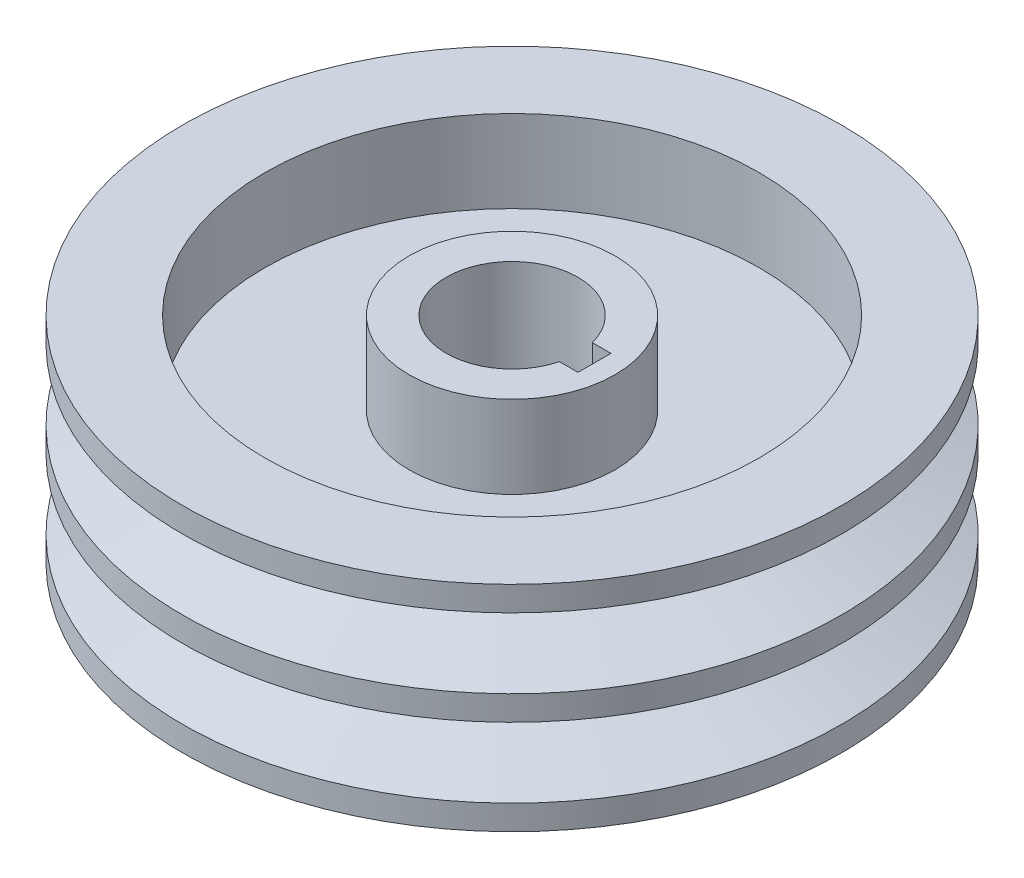
ISO-10303-21;
HEADER;
FILE_DESCRIPTION(('STEP AP214'),'2;1');
FILE_NAME('part.step','',(''),(''),'','','');
FILE_SCHEMA(('AUTOMOTIVE_DESIGN { 1 0 10303 214 1 1 1 1 }'));
ENDSEC;
DATA;
#1=APPLICATION_CONTEXT('core data for automotive mechanical design processes');
#2=APPLICATION_PROTOCOL_DEFINITION('international standard','automotive_design',2000,#1);
#3=PRODUCT_CONTEXT('',#1,'mechanical');
#4=PRODUCT('Part','Part','',(#3));
#5=PRODUCT_RELATED_PRODUCT_CATEGORY('part','',(#4));
#6=PRODUCT_DEFINITION_FORMATION('','',#4);
#7=PRODUCT_DEFINITION_CONTEXT('part definition',#1,'design');
#8=PRODUCT_DEFINITION('design','',#6,#7);
#9=PRODUCT_DEFINITION_SHAPE('','',#8);
#10=(LENGTH_UNIT() NAMED_UNIT(*) SI_UNIT(.MILLI.,.METRE.));
#11=(NAMED_UNIT(*) PLANE_ANGLE_UNIT() SI_UNIT($,.RADIAN.));
#12=(NAMED_UNIT(*) SI_UNIT($,.STERADIAN.) SOLID_ANGLE_UNIT());
#13=UNCERTAINTY_MEASURE_WITH_UNIT(LENGTH_MEASURE(1.E-05),#10,'distance_accuracy_value','');
#14=(GEOMETRIC_REPRESENTATION_CONTEXT(3) GLOBAL_UNCERTAINTY_ASSIGNED_CONTEXT((#13)) GLOBAL_UNIT_ASSIGNED_CONTEXT((#10,
#11,#12)) REPRESENTATION_CONTEXT('',''));
#15=CARTESIAN_POINT('',(0.,0.,0.));
#16=DIRECTION('',(0.,0.,1.));
#17=DIRECTION('',(1.,0.,0.));
#18=AXIS2_PLACEMENT_3D('',#15,#16,#17);
#19=CARTESIAN_POINT('',(0.,1.5,0.));
#20=DIRECTION('',(0.,-1.,0.));
#21=DIRECTION('',(0.,0.,-1.));
#22=AXIS2_PLACEMENT_3D('',#19,#20,#21);
#23=CONICAL_SURFACE('',#22,40.,1.22173047639603);
#24=CARTESIAN_POINT('',(0.,4.4117618741296,0.));
#25=DIRECTION('',(0.,-1.,0.));
#26=DIRECTION('',(0.,0.,-1.));
#27=AXIS2_PLACEMENT_3D('',#24,#25,#26);
#28=CIRCLE('',#27,32.);
#29=CARTESIAN_POINT('',(0.,4.4117618741296,-32.));
#30=VERTEX_POINT('',#29);
#31=EDGE_CURVE('E39',#30,#30,#28,.T.);
#32=ORIENTED_EDGE('',*,*,#31,.T.);
#33=EDGE_LOOP('',(#32));
#34=FACE_BOUND('',#33,.T.);
#35=CARTESIAN_POINT('',(0.,1.5,0.));
#36=DIRECTION('',(0.,-1.,0.));
#37=DIRECTION('',(0.,0.,-1.));
#38=AXIS2_PLACEMENT_3D('',#35,#36,#37);
#39=CIRCLE('',#38,40.);
#40=CARTESIAN_POINT('',(0.,1.5,-40.));
#41=VERTEX_POINT('',#40);
#42=EDGE_CURVE('E100',#41,#41,#39,.T.);
#43=ORIENTED_EDGE('',*,*,#42,.F.);
#44=EDGE_LOOP('',(#43));
#45=FACE_BOUND('',#44,.T.);
#46=ADVANCED_FACE('F32',(#34,#45),#23,.T.);
#47=CARTESIAN_POINT('',(0.,0.,0.));
#48=DIRECTION('',(0.,-1.,0.));
#49=DIRECTION('',(0.,0.,-1.));
#50=AXIS2_PLACEMENT_3D('',#47,#48,#49);
#51=CYLINDRICAL_SURFACE('',#50,32.);
#52=CARTESIAN_POINT('',(0.,7.0882381258704,0.));
#53=DIRECTION('',(0.,-1.,0.));
#54=DIRECTION('',(0.,0.,-1.));
#55=AXIS2_PLACEMENT_3D('',#52,#53,#54);
#56=CIRCLE('',#55,32.);
#57=CARTESIAN_POINT('',(0.,7.0882381258704,-32.));
#58=VERTEX_POINT('',#57);
#59=EDGE_CURVE('E153',#58,#58,#56,.T.);
#60=ORIENTED_EDGE('',*,*,#59,.T.);
#61=EDGE_LOOP('',(#60));
#62=FACE_BOUND('',#61,.T.);
#63=ORIENTED_EDGE('',*,*,#31,.F.);
#64=EDGE_LOOP('',(#63));
#65=FACE_BOUND('',#64,.T.);
#66=ADVANCED_FACE('F160',(#62,#65),#51,.T.);
#67=CARTESIAN_POINT('',(0.,7.0882381258704,0.));
#68=DIRECTION('',(0.,1.,0.));
#69=DIRECTION('',(0.,0.,1.));
#70=AXIS2_PLACEMENT_3D('',#67,#68,#69);
#71=CONICAL_SURFACE('',#70,32.,1.22173047639603);
#72=CARTESIAN_POINT('',(0.,10.,0.));
#73=DIRECTION('',(0.,-1.,0.));
#74=DIRECTION('',(0.,0.,-1.));
#75=AXIS2_PLACEMENT_3D('',#72,#73,#74);
#76=CIRCLE('',#75,40.);
#77=CARTESIAN_POINT('',(0.,10.,-40.));
#78=VERTEX_POINT('',#77);
#79=EDGE_CURVE('E150',#78,#78,#76,.T.);
#80=ORIENTED_EDGE('',*,*,#79,.T.);
#81=EDGE_LOOP('',(#80));
#82=FACE_BOUND('',#81,.T.);
#83=ORIENTED_EDGE('',*,*,#59,.F.);
#84=EDGE_LOOP('',(#83));
#85=FACE_BOUND('',#84,.T.);
#86=ADVANCED_FACE('F162',(#82,#85),#71,.T.);
#87=CARTESIAN_POINT('',(0.,0.,0.));
#88=DIRECTION('',(0.,-1.,0.));
#89=DIRECTION('',(0.,0.,-1.));
#90=AXIS2_PLACEMENT_3D('',#87,#88,#89);
#91=CYLINDRICAL_SURFACE('',#90,40.);
#92=CARTESIAN_POINT('',(0.,13.,0.));
#93=DIRECTION('',(0.,-1.,0.));
#94=DIRECTION('',(0.,0.,-1.));
#95=AXIS2_PLACEMENT_3D('',#92,#93,#94);
#96=CIRCLE('',#95,40.);
#97=CARTESIAN_POINT('',(0.,13.,-40.));
#98=VERTEX_POINT('',#97);
#99=EDGE_CURVE('E147',#98,#98,#96,.T.);
#100=ORIENTED_EDGE('',*,*,#99,.T.);
#101=EDGE_LOOP('',(#100));
#102=FACE_BOUND('',#101,.T.);
#103=ORIENTED_EDGE('',*,*,#79,.F.);
#104=EDGE_LOOP('',(#103));
#105=FACE_BOUND('',#104,.T.);
#106=ADVANCED_FACE('F168',(#102,#105),#91,.T.);
#107=CARTESIAN_POINT('',(30.,13.,0.));
#108=DIRECTION('',(0.,1.,0.));
#109=DIRECTION('',(0.,0.,1.));
#110=AXIS2_PLACEMENT_3D('',#107,#108,#109);
#111=PLANE('',#110);
#112=CARTESIAN_POINT('',(0.,13.,0.));
#113=DIRECTION('',(0.,-1.,0.));
#114=DIRECTION('',(0.,0.,-1.));
#115=AXIS2_PLACEMENT_3D('',#112,#113,#114);
#116=CIRCLE('',#115,30.);
#117=CARTESIAN_POINT('',(0.,13.,-30.));
#118=VERTEX_POINT('',#117);
#119=EDGE_CURVE('E144',#118,#118,#116,.T.);
#120=ORIENTED_EDGE('',*,*,#119,.T.);
#121=EDGE_LOOP('',(#120));
#122=FACE_BOUND('',#121,.T.);
#123=ORIENTED_EDGE('',*,*,#99,.F.);
#124=EDGE_LOOP('',(#123));
#125=FACE_BOUND('',#124,.T.);
#126=ADVANCED_FACE('F174',(#122,#125),#111,.T.);
#127=CARTESIAN_POINT('',(0.,0.,0.));
#128=DIRECTION('',(0.,-1.,0.));
#129=DIRECTION('',(0.,0.,-1.));
#130=AXIS2_PLACEMENT_3D('',#127,#128,#129);
#131=CYLINDRICAL_SURFACE('',#130,30.);
#132=CARTESIAN_POINT('',(0.,3.,0.));
#133=DIRECTION('',(0.,-1.,0.));
#134=DIRECTION('',(0.,0.,-1.));
#135=AXIS2_PLACEMENT_3D('',#132,#133,#134);
#136=CIRCLE('',#135,30.);
#137=CARTESIAN_POINT('',(0.,3.,-30.));
#138=VERTEX_POINT('',#137);
#139=EDGE_CURVE('E141',#138,#138,#136,.T.);
#140=ORIENTED_EDGE('',*,*,#139,.T.);
#141=EDGE_LOOP('',(#140));
#142=FACE_BOUND('',#141,.T.);
#143=ORIENTED_EDGE('',*,*,#119,.F.);
#144=EDGE_LOOP('',(#143));
#145=FACE_BOUND('',#144,.T.);
#146=ADVANCED_FACE('F178',(#142,#145),#131,.F.);
#147=CARTESIAN_POINT('',(30.,3.,0.));
#148=DIRECTION('',(0.,1.,0.));
#149=DIRECTION('',(0.,0.,1.));
#150=AXIS2_PLACEMENT_3D('',#147,#148,#149);
#151=PLANE('',#150);
#152=CARTESIAN_POINT('',(0.,3.,0.));
#153=DIRECTION('',(0.,-1.,0.));
#154=DIRECTION('',(0.,0.,-1.));
#155=AXIS2_PLACEMENT_3D('',#152,#153,#154);
#156=CIRCLE('',#155,12.5);
#157=CARTESIAN_POINT('',(0.,3.,-12.5));
#158=VERTEX_POINT('',#157);
#159=EDGE_CURVE('E138',#158,#158,#156,.T.);
#160=ORIENTED_EDGE('',*,*,#159,.T.);
#161=EDGE_LOOP('',(#160));
#162=FACE_BOUND('',#161,.T.);
#163=ORIENTED_EDGE('',*,*,#139,.F.);
#164=EDGE_LOOP('',(#163));
#165=FACE_BOUND('',#164,.T.);
#166=ADVANCED_FACE('F182',(#162,#165),#151,.T.);
#167=CARTESIAN_POINT('',(0.,0.,0.));
#168=DIRECTION('',(0.,-1.,0.));
#169=DIRECTION('',(0.,0.,-1.));
#170=AXIS2_PLACEMENT_3D('',#167,#168,#169);
#171=CYLINDRICAL_SURFACE('',#170,12.5);
#172=CARTESIAN_POINT('',(0.,13.,0.));
#173=DIRECTION('',(0.,-1.,0.));
#174=DIRECTION('',(0.,0.,-1.));
#175=AXIS2_PLACEMENT_3D('',#172,#173,#174);
#176=CIRCLE('',#175,12.5);
#177=CARTESIAN_POINT('',(0.,13.,-12.5));
#178=VERTEX_POINT('',#177);
#179=EDGE_CURVE('E135',#178,#178,#176,.T.);
#180=ORIENTED_EDGE('',*,*,#179,.T.);
#181=EDGE_LOOP('',(#180));
#182=FACE_BOUND('',#181,.T.);
#183=ORIENTED_EDGE('',*,*,#159,.F.);
#184=EDGE_LOOP('',(#183));
#185=FACE_BOUND('',#184,.T.);
#186=ADVANCED_FACE('F186',(#182,#185),#171,.T.);
#187=CARTESIAN_POINT('',(12.5,13.,0.));
#188=DIRECTION('',(0.,1.,0.));
#189=DIRECTION('',(0.,0.,1.));
#190=AXIS2_PLACEMENT_3D('',#187,#188,#189);
#191=PLANE('',#190);
#192=DIRECTION('',(1.,0.,0.));
#193=VECTOR('',#192,1.);
#194=CARTESIAN_POINT('',(0.,13.,2.));
#195=LINE('',#194,#193);
#196=CARTESIAN_POINT('',(7.74596669241484,13.,2.));
#197=VERTEX_POINT('',#196);
#198=CARTESIAN_POINT('',(10.,13.,2.));
#199=VERTEX_POINT('',#198);
#200=EDGE_CURVE('E89',#197,#199,#195,.T.);
#201=ORIENTED_EDGE('',*,*,#200,.F.);
#202=CARTESIAN_POINT('',(0.,13.,0.));
#203=DIRECTION('',(0.,-1.,0.));
#204=DIRECTION('',(0.,0.,-1.));
#205=AXIS2_PLACEMENT_3D('',#202,#203,#204);
#206=CIRCLE('',#205,8.);
#207=CARTESIAN_POINT('',(7.74596669241484,13.,-2.));
#208=VERTEX_POINT('',#207);
#209=EDGE_CURVE('E132',#197,#208,#206,.T.);
#210=ORIENTED_EDGE('',*,*,#209,.T.);
#211=DIRECTION('',(-1.,0.,0.));
#212=VECTOR('',#211,1.);
#213=CARTESIAN_POINT('',(0.,13.,-2.));
#214=LINE('',#213,#212);
#215=CARTESIAN_POINT('',(10.,13.,-2.));
#216=VERTEX_POINT('',#215);
#217=EDGE_CURVE('E91',#216,#208,#214,.T.);
#218=ORIENTED_EDGE('',*,*,#217,.F.);
#219=DIRECTION('',(0.,0.,-1.));
#220=VECTOR('',#219,1.);
#221=CARTESIAN_POINT('',(10.,13.,2.));
#222=LINE('',#221,#220);
#223=EDGE_CURVE('E77',#199,#216,#222,.T.);
#224=ORIENTED_EDGE('',*,*,#223,.F.);
#225=EDGE_LOOP('',(#201,#210,#218,#224));
#226=FACE_BOUND('',#225,.T.);
#227=ORIENTED_EDGE('',*,*,#179,.F.);
#228=EDGE_LOOP('',(#227));
#229=FACE_BOUND('',#228,.T.);
#230=ADVANCED_FACE('F190',(#226,#229),#191,.T.);
#231=CARTESIAN_POINT('',(0.,0.,0.));
#232=DIRECTION('',(0.,-1.,0.));
#233=DIRECTION('',(0.,0.,-1.));
#234=AXIS2_PLACEMENT_3D('',#231,#232,#233);
#235=CYLINDRICAL_SURFACE('',#234,8.);
#236=DIRECTION('',(0.,-1.,0.));
#237=VECTOR('',#236,1.);
#238=CARTESIAN_POINT('',(7.74596669241484,0.,2.));
#239=LINE('',#238,#237);
#240=CARTESIAN_POINT('',(7.74596669241484,-13.,2.));
#241=VERTEX_POINT('',#240);
#242=EDGE_CURVE('E98',#241,#197,#239,.F.);
#243=ORIENTED_EDGE('',*,*,#242,.F.);
#244=CARTESIAN_POINT('',(0.,-13.,0.));
#245=DIRECTION('',(0.,-1.,0.));
#246=DIRECTION('',(0.,0.,-1.));
#247=AXIS2_PLACEMENT_3D('',#244,#245,#246);
#248=CIRCLE('',#247,8.);
#249=CARTESIAN_POINT('',(7.74596669241484,-13.,-2.));
#250=VERTEX_POINT('',#249);
#251=EDGE_CURVE('E130',#241,#250,#248,.T.);
#252=ORIENTED_EDGE('',*,*,#251,.T.);
#253=DIRECTION('',(0.,-1.,0.));
#254=VECTOR('',#253,1.);
#255=CARTESIAN_POINT('',(7.74596669241484,0.,-2.));
#256=LINE('',#255,#254);
#257=EDGE_CURVE('E46',#208,#250,#256,.T.);
#258=ORIENTED_EDGE('',*,*,#257,.F.);
#259=ORIENTED_EDGE('',*,*,#209,.F.);
#260=EDGE_LOOP('',(#243,#252,#258,#259));
#261=FACE_BOUND('',#260,.T.);
#262=ADVANCED_FACE('F194',(#261),#235,.F.);
#263=CARTESIAN_POINT('',(12.5,-13.,0.));
#264=DIRECTION('',(0.,-1.,0.));
#265=DIRECTION('',(0.,0.,-1.));
#266=AXIS2_PLACEMENT_3D('',#263,#264,#265);
#267=PLANE('',#266);
#268=DIRECTION('',(-1.,0.,0.));
#269=VECTOR('',#268,1.);
#270=CARTESIAN_POINT('',(12.5,-13.,2.));
#271=LINE('',#270,#269);
#272=CARTESIAN_POINT('',(10.,-13.,2.));
#273=VERTEX_POINT('',#272);
#274=EDGE_CURVE('E11',#273,#241,#271,.T.);
#275=ORIENTED_EDGE('',*,*,#274,.F.);
#276=DIRECTION('',(0.,0.,-1.));
#277=VECTOR('',#276,1.);
#278=CARTESIAN_POINT('',(10.,-13.,2.));
#279=LINE('',#278,#277);
#280=CARTESIAN_POINT('',(10.,-13.,-2.));
#281=VERTEX_POINT('',#280);
#282=EDGE_CURVE('E75',#273,#281,#279,.T.);
#283=ORIENTED_EDGE('',*,*,#282,.T.);
#284=DIRECTION('',(-1.,0.,0.));
#285=VECTOR('',#284,1.);
#286=CARTESIAN_POINT('',(0.,-13.,-2.));
#287=LINE('',#286,#285);
#288=EDGE_CURVE('E80',#281,#250,#287,.T.);
#289=ORIENTED_EDGE('',*,*,#288,.T.);
#290=ORIENTED_EDGE('',*,*,#251,.F.);
#291=EDGE_LOOP('',(#275,#283,#289,#290));
#292=FACE_BOUND('',#291,.T.);
#293=CARTESIAN_POINT('',(0.,-13.,0.));
#294=DIRECTION('',(0.,-1.,0.));
#295=DIRECTION('',(0.,0.,-1.));
#296=AXIS2_PLACEMENT_3D('',#293,#294,#295);
#297=CIRCLE('',#296,12.5);
#298=CARTESIAN_POINT('',(0.,-13.,-12.5));
#299=VERTEX_POINT('',#298);
#300=EDGE_CURVE('E127',#299,#299,#297,.T.);
#301=ORIENTED_EDGE('',*,*,#300,.T.);
#302=EDGE_LOOP('',(#301));
#303=FACE_BOUND('',#302,.T.);
#304=ADVANCED_FACE('F87',(#292,#303),#267,.T.);
#305=CARTESIAN_POINT('',(0.,0.,0.));
#306=DIRECTION('',(0.,-1.,0.));
#307=DIRECTION('',(0.,0.,-1.));
#308=AXIS2_PLACEMENT_3D('',#305,#306,#307);
#309=CYLINDRICAL_SURFACE('',#308,12.5);
#310=CARTESIAN_POINT('',(0.,-3.,0.));
#311=DIRECTION('',(0.,-1.,0.));
#312=DIRECTION('',(0.,0.,-1.));
#313=AXIS2_PLACEMENT_3D('',#310,#311,#312);
#314=CIRCLE('',#313,12.5);
#315=CARTESIAN_POINT('',(0.,-3.,-12.5));
#316=VERTEX_POINT('',#315);
#317=EDGE_CURVE('E124',#316,#316,#314,.T.);
#318=ORIENTED_EDGE('',*,*,#317,.T.);
#319=EDGE_LOOP('',(#318));
#320=FACE_BOUND('',#319,.T.);
#321=ORIENTED_EDGE('',*,*,#300,.F.);
#322=EDGE_LOOP('',(#321));
#323=FACE_BOUND('',#322,.T.);
#324=ADVANCED_FACE('F201',(#320,#323),#309,.T.);
#325=CARTESIAN_POINT('',(30.,-3.,0.));
#326=DIRECTION('',(0.,-1.,0.));
#327=DIRECTION('',(0.,0.,-1.));
#328=AXIS2_PLACEMENT_3D('',#325,#326,#327);
#329=PLANE('',#328);
#330=CARTESIAN_POINT('',(0.,-3.,0.));
#331=DIRECTION('',(0.,-1.,0.));
#332=DIRECTION('',(0.,0.,-1.));
#333=AXIS2_PLACEMENT_3D('',#330,#331,#332);
#334=CIRCLE('',#333,30.);
#335=CARTESIAN_POINT('',(0.,-3.,-30.));
#336=VERTEX_POINT('',#335);
#337=EDGE_CURVE('E121',#336,#336,#334,.T.);
#338=ORIENTED_EDGE('',*,*,#337,.T.);
#339=EDGE_LOOP('',(#338));
#340=FACE_BOUND('',#339,.T.);
#341=ORIENTED_EDGE('',*,*,#317,.F.);
#342=EDGE_LOOP('',(#341));
#343=FACE_BOUND('',#342,.T.);
#344=ADVANCED_FACE('F204',(#340,#343),#329,.T.);
#345=CARTESIAN_POINT('',(0.,0.,0.));
#346=DIRECTION('',(0.,-1.,0.));
#347=DIRECTION('',(0.,0.,-1.));
#348=AXIS2_PLACEMENT_3D('',#345,#346,#347);
#349=CYLINDRICAL_SURFACE('',#348,30.);
#350=CARTESIAN_POINT('',(0.,-13.,0.));
#351=DIRECTION('',(0.,-1.,0.));
#352=DIRECTION('',(0.,0.,-1.));
#353=AXIS2_PLACEMENT_3D('',#350,#351,#352);
#354=CIRCLE('',#353,30.);
#355=CARTESIAN_POINT('',(0.,-13.,-30.));
#356=VERTEX_POINT('',#355);
#357=EDGE_CURVE('E118',#356,#356,#354,.T.);
#358=ORIENTED_EDGE('',*,*,#357,.T.);
#359=EDGE_LOOP('',(#358));
#360=FACE_BOUND('',#359,.T.);
#361=ORIENTED_EDGE('',*,*,#337,.F.);
#362=EDGE_LOOP('',(#361));
#363=FACE_BOUND('',#362,.T.);
#364=ADVANCED_FACE('F208',(#360,#363),#349,.F.);
#365=CARTESIAN_POINT('',(30.,-13.,0.));
#366=DIRECTION('',(0.,-1.,0.));
#367=DIRECTION('',(0.,0.,-1.));
#368=AXIS2_PLACEMENT_3D('',#365,#366,#367);
#369=PLANE('',#368);
#370=CARTESIAN_POINT('',(0.,-13.,0.));
#371=DIRECTION('',(0.,-1.,0.));
#372=DIRECTION('',(0.,0.,-1.));
#373=AXIS2_PLACEMENT_3D('',#370,#371,#372);
#374=CIRCLE('',#373,40.);
#375=CARTESIAN_POINT('',(0.,-13.,-40.));
#376=VERTEX_POINT('',#375);
#377=EDGE_CURVE('E115',#376,#376,#374,.T.);
#378=ORIENTED_EDGE('',*,*,#377,.T.);
#379=EDGE_LOOP('',(#378));
#380=FACE_BOUND('',#379,.T.);
#381=ORIENTED_EDGE('',*,*,#357,.F.);
#382=EDGE_LOOP('',(#381));
#383=FACE_BOUND('',#382,.T.);
#384=ADVANCED_FACE('F212',(#380,#383),#369,.T.);
#385=CARTESIAN_POINT('',(0.,0.,0.));
#386=DIRECTION('',(0.,-1.,0.));
#387=DIRECTION('',(0.,0.,-1.));
#388=AXIS2_PLACEMENT_3D('',#385,#386,#387);
#389=CYLINDRICAL_SURFACE('',#388,40.);
#390=CARTESIAN_POINT('',(0.,-9.99999999999999,0.));
#391=DIRECTION('',(0.,-1.,0.));
#392=DIRECTION('',(0.,0.,-1.));
#393=AXIS2_PLACEMENT_3D('',#390,#391,#392);
#394=CIRCLE('',#393,40.);
#395=CARTESIAN_POINT('',(0.,-9.99999999999999,-40.));
#396=VERTEX_POINT('',#395);
#397=EDGE_CURVE('E112',#396,#396,#394,.T.);
#398=ORIENTED_EDGE('',*,*,#397,.T.);
#399=EDGE_LOOP('',(#398));
#400=FACE_BOUND('',#399,.T.);
#401=ORIENTED_EDGE('',*,*,#377,.F.);
#402=EDGE_LOOP('',(#401));
#403=FACE_BOUND('',#402,.T.);
#404=ADVANCED_FACE('F216',(#400,#403),#389,.T.);
#405=CARTESIAN_POINT('',(0.,-9.99999999999999,0.));
#406=DIRECTION('',(0.,-1.,0.));
#407=DIRECTION('',(0.,0.,-1.));
#408=AXIS2_PLACEMENT_3D('',#405,#406,#407);
#409=CONICAL_SURFACE('',#408,40.,1.22173047639604);
#410=CARTESIAN_POINT('',(0.,-7.08823812587042,0.));
#411=DIRECTION('',(0.,-1.,0.));
#412=DIRECTION('',(0.,0.,-1.));
#413=AXIS2_PLACEMENT_3D('',#410,#411,#412);
#414=CIRCLE('',#413,32.);
#415=CARTESIAN_POINT('',(0.,-7.08823812587042,-32.));
#416=VERTEX_POINT('',#415);
#417=EDGE_CURVE('E109',#416,#416,#414,.T.);
#418=ORIENTED_EDGE('',*,*,#417,.T.);
#419=EDGE_LOOP('',(#418));
#420=FACE_BOUND('',#419,.T.);
#421=ORIENTED_EDGE('',*,*,#397,.F.);
#422=EDGE_LOOP('',(#421));
#423=FACE_BOUND('',#422,.T.);
#424=ADVANCED_FACE('F220',(#420,#423),#409,.T.);
#425=CARTESIAN_POINT('',(0.,0.,0.));
#426=DIRECTION('',(0.,-1.,0.));
#427=DIRECTION('',(0.,0.,-1.));
#428=AXIS2_PLACEMENT_3D('',#425,#426,#427);
#429=CYLINDRICAL_SURFACE('',#428,32.);
#430=CARTESIAN_POINT('',(0.,-4.4117618741296,0.));
#431=DIRECTION('',(0.,-1.,0.));
#432=DIRECTION('',(0.,0.,-1.));
#433=AXIS2_PLACEMENT_3D('',#430,#431,#432);
#434=CIRCLE('',#433,32.);
#435=CARTESIAN_POINT('',(0.,-4.4117618741296,-32.));
#436=VERTEX_POINT('',#435);
#437=EDGE_CURVE('E106',#436,#436,#434,.T.);
#438=ORIENTED_EDGE('',*,*,#437,.T.);
#439=EDGE_LOOP('',(#438));
#440=FACE_BOUND('',#439,.T.);
#441=ORIENTED_EDGE('',*,*,#417,.F.);
#442=EDGE_LOOP('',(#441));
#443=FACE_BOUND('',#442,.T.);
#444=ADVANCED_FACE('F224',(#440,#443),#429,.T.);
#445=CARTESIAN_POINT('',(0.,-4.4117618741296,0.));
#446=DIRECTION('',(0.,1.,0.));
#447=DIRECTION('',(0.,0.,1.));
#448=AXIS2_PLACEMENT_3D('',#445,#446,#447);
#449=CONICAL_SURFACE('',#448,32.,1.22173047639603);
#450=CARTESIAN_POINT('',(0.,-1.5,0.));
#451=DIRECTION('',(0.,-1.,0.));
#452=DIRECTION('',(0.,0.,-1.));
#453=AXIS2_PLACEMENT_3D('',#450,#451,#452);
#454=CIRCLE('',#453,40.);
#455=CARTESIAN_POINT('',(0.,-1.5,-40.));
#456=VERTEX_POINT('',#455);
#457=EDGE_CURVE('E103',#456,#456,#454,.T.);
#458=ORIENTED_EDGE('',*,*,#457,.T.);
#459=EDGE_LOOP('',(#458));
#460=FACE_BOUND('',#459,.T.);
#461=ORIENTED_EDGE('',*,*,#437,.F.);
#462=EDGE_LOOP('',(#461));
#463=FACE_BOUND('',#462,.T.);
#464=ADVANCED_FACE('F228',(#460,#463),#449,.T.);
#465=CARTESIAN_POINT('',(0.,0.,0.));
#466=DIRECTION('',(0.,-1.,0.));
#467=DIRECTION('',(0.,0.,-1.));
#468=AXIS2_PLACEMENT_3D('',#465,#466,#467);
#469=CYLINDRICAL_SURFACE('',#468,40.);
#470=ORIENTED_EDGE('',*,*,#42,.T.);
#471=EDGE_LOOP('',(#470));
#472=FACE_BOUND('',#471,.T.);
#473=ORIENTED_EDGE('',*,*,#457,.F.);
#474=EDGE_LOOP('',(#473));
#475=FACE_BOUND('',#474,.T.);
#476=ADVANCED_FACE('F232',(#472,#475),#469,.T.);
#477=CARTESIAN_POINT('',(10.,-13.,2.));
#478=DIRECTION('',(1.,0.,0.));
#479=DIRECTION('',(0.,0.,-1.));
#480=AXIS2_PLACEMENT_3D('',#477,#478,#479);
#481=PLANE('',#480);
#482=ORIENTED_EDGE('',*,*,#223,.T.);
#483=DIRECTION('',(0.,1.,0.));
#484=VECTOR('',#483,1.);
#485=CARTESIAN_POINT('',(10.,-13.,-2.));
#486=LINE('',#485,#484);
#487=EDGE_CURVE('E71',#281,#216,#486,.T.);
#488=ORIENTED_EDGE('',*,*,#487,.F.);
#489=ORIENTED_EDGE('',*,*,#282,.F.);
#490=DIRECTION('',(0.,1.,0.));
#491=VECTOR('',#490,1.);
#492=CARTESIAN_POINT('',(10.,-13.,2.));
#493=LINE('',#492,#491);
#494=EDGE_CURVE('E79',#273,#199,#493,.T.);
#495=ORIENTED_EDGE('',*,*,#494,.T.);
#496=EDGE_LOOP('',(#482,#488,#489,#495));
#497=FACE_BOUND('',#496,.T.);
#498=ADVANCED_FACE('F72',(#497),#481,.F.);
#499=CARTESIAN_POINT('',(0.,-13.,2.));
#500=DIRECTION('',(0.,0.,1.));
#501=DIRECTION('',(1.,0.,0.));
#502=AXIS2_PLACEMENT_3D('',#499,#500,#501);
#503=PLANE('',#502);
#504=ORIENTED_EDGE('',*,*,#242,.T.);
#505=ORIENTED_EDGE('',*,*,#200,.T.);
#506=ORIENTED_EDGE('',*,*,#494,.F.);
#507=ORIENTED_EDGE('',*,*,#274,.T.);
#508=EDGE_LOOP('',(#504,#505,#506,#507));
#509=FACE_BOUND('',#508,.T.);
#510=ADVANCED_FACE('F239',(#509),#503,.F.);
#511=CARTESIAN_POINT('',(0.,-13.,-2.));
#512=DIRECTION('',(0.,0.,-1.));
#513=DIRECTION('',(-1.,0.,0.));
#514=AXIS2_PLACEMENT_3D('',#511,#512,#513);
#515=PLANE('',#514);
#516=ORIENTED_EDGE('',*,*,#257,.T.);
#517=ORIENTED_EDGE('',*,*,#288,.F.);
#518=ORIENTED_EDGE('',*,*,#487,.T.);
#519=ORIENTED_EDGE('',*,*,#217,.T.);
#520=EDGE_LOOP('',(#516,#517,#518,#519));
#521=FACE_BOUND('',#520,.T.);
#522=ADVANCED_FACE('F82',(#521),#515,.F.);
#523=CLOSED_SHELL('',(#46,#66,#86,#106,#126,#146,#166,#186,#230,#262,#304,#324,#344,#364,#384,
#404,#424,#444,#464,#476,#498,#510,#522));
#524=MANIFOLD_SOLID_BREP('B2',#523);
#525=ADVANCED_BREP_SHAPE_REPRESENTATION('',(#18,#524),#14);
#526=SHAPE_DEFINITION_REPRESENTATION(#9,#525);
ENDSEC;
END-ISO-10303-21;
